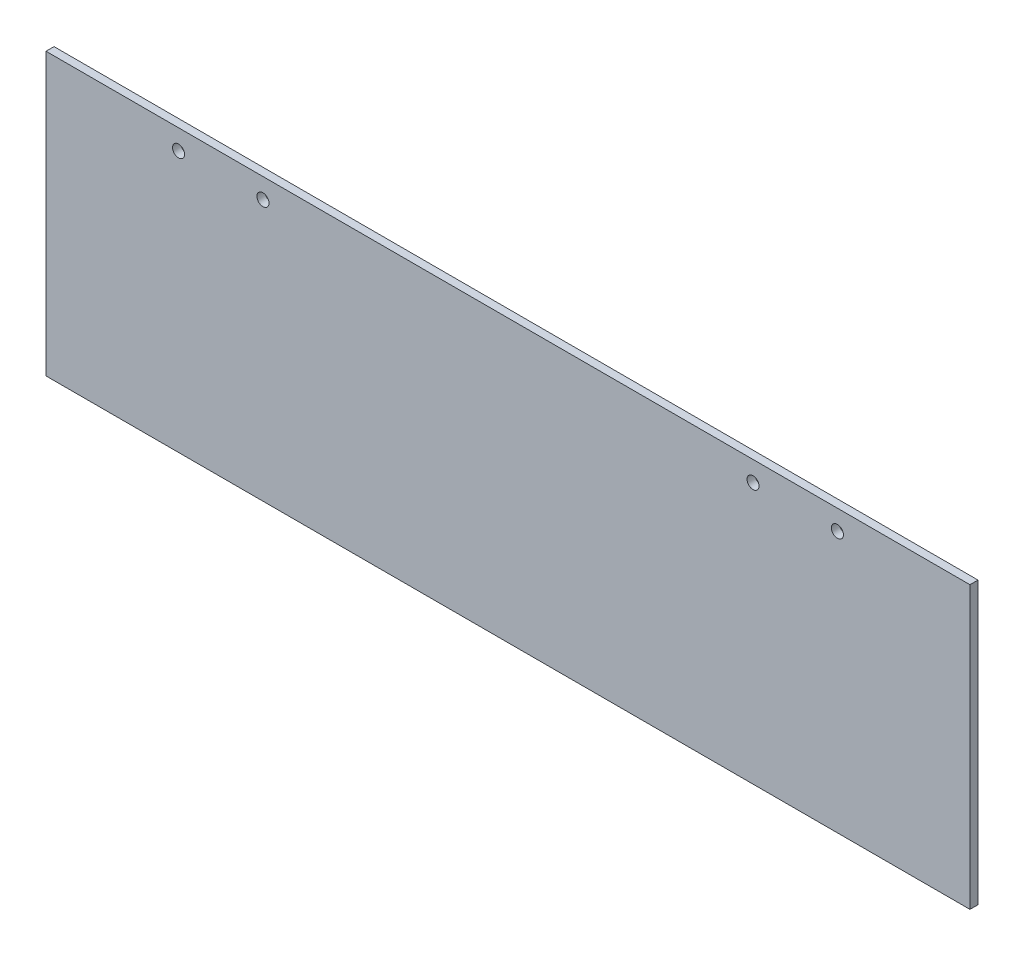
ISO-10303-21;
HEADER;
FILE_DESCRIPTION(('STEP AP214'),'2;1');
FILE_NAME('part.step','',(''),(''),'','','');
FILE_SCHEMA(('AUTOMOTIVE_DESIGN { 1 0 10303 214 1 1 1 1 }'));
ENDSEC;
DATA;
#1=APPLICATION_CONTEXT('core data for automotive mechanical design processes');
#2=APPLICATION_PROTOCOL_DEFINITION('international standard','automotive_design',2000,#1);
#3=PRODUCT_CONTEXT('',#1,'mechanical');
#4=PRODUCT('Part','Part','',(#3));
#5=PRODUCT_RELATED_PRODUCT_CATEGORY('part','',(#4));
#6=PRODUCT_DEFINITION_FORMATION('','',#4);
#7=PRODUCT_DEFINITION_CONTEXT('part definition',#1,'design');
#8=PRODUCT_DEFINITION('design','',#6,#7);
#9=PRODUCT_DEFINITION_SHAPE('','',#8);
#10=(LENGTH_UNIT() NAMED_UNIT(*) SI_UNIT(.MILLI.,.METRE.));
#11=(NAMED_UNIT(*) PLANE_ANGLE_UNIT() SI_UNIT($,.RADIAN.));
#12=(NAMED_UNIT(*) SI_UNIT($,.STERADIAN.) SOLID_ANGLE_UNIT());
#13=UNCERTAINTY_MEASURE_WITH_UNIT(LENGTH_MEASURE(1.E-05),#10,'distance_accuracy_value','');
#14=(GEOMETRIC_REPRESENTATION_CONTEXT(3) GLOBAL_UNCERTAINTY_ASSIGNED_CONTEXT((#13)) GLOBAL_UNIT_ASSIGNED_CONTEXT((#10,
#11,#12)) REPRESENTATION_CONTEXT('',''));
#15=CARTESIAN_POINT('',(0.,0.,0.));
#16=DIRECTION('',(0.,0.,1.));
#17=DIRECTION('',(1.,0.,0.));
#18=AXIS2_PLACEMENT_3D('',#15,#16,#17);
#19=CARTESIAN_POINT('',(0.,0.,2.));
#20=DIRECTION('',(0.,0.,1.));
#21=DIRECTION('',(1.,0.,0.));
#22=AXIS2_PLACEMENT_3D('',#19,#20,#21);
#23=PLANE('',#22);
#24=CARTESIAN_POINT('',(61.,30.,2.));
#25=DIRECTION('',(0.,0.,1.));
#26=DIRECTION('',(1.,0.,0.));
#27=AXIS2_PLACEMENT_3D('',#24,#25,#26);
#28=CIRCLE('',#27,1.5);
#29=CARTESIAN_POINT('',(62.5,30.,2.));
#30=VERTEX_POINT('',#29);
#31=EDGE_CURVE('E121',#30,#30,#28,.T.);
#32=ORIENTED_EDGE('',*,*,#31,.F.);
#33=EDGE_LOOP('',(#32));
#34=FACE_BOUND('',#33,.T.);
#35=CARTESIAN_POINT('',(-82.,30.,2.));
#36=DIRECTION('',(0.,0.,1.));
#37=DIRECTION('',(1.,0.,0.));
#38=AXIS2_PLACEMENT_3D('',#35,#36,#37);
#39=CIRCLE('',#38,1.5);
#40=CARTESIAN_POINT('',(-80.5,30.,2.));
#41=VERTEX_POINT('',#40);
#42=EDGE_CURVE('E100',#41,#41,#39,.T.);
#43=ORIENTED_EDGE('',*,*,#42,.F.);
#44=EDGE_LOOP('',(#43));
#45=FACE_BOUND('',#44,.T.);
#46=DIRECTION('',(0.,-1.,0.));
#47=VECTOR('',#46,1.);
#48=CARTESIAN_POINT('',(-115.,35.,2.));
#49=LINE('',#48,#47);
#50=CARTESIAN_POINT('',(-115.,35.,2.));
#51=VERTEX_POINT('',#50);
#52=CARTESIAN_POINT('',(-115.,-35.,2.));
#53=VERTEX_POINT('',#52);
#54=EDGE_CURVE('E85',#51,#53,#49,.T.);
#55=ORIENTED_EDGE('',*,*,#54,.T.);
#56=DIRECTION('',(1.,0.,0.));
#57=VECTOR('',#56,1.);
#58=CARTESIAN_POINT('',(-115.,-35.,2.));
#59=LINE('',#58,#57);
#60=CARTESIAN_POINT('',(115.,-35.,2.));
#61=VERTEX_POINT('',#60);
#62=EDGE_CURVE('E80',#53,#61,#59,.T.);
#63=ORIENTED_EDGE('',*,*,#62,.T.);
#64=DIRECTION('',(0.,1.,0.));
#65=VECTOR('',#64,1.);
#66=CARTESIAN_POINT('',(115.,35.,2.));
#67=LINE('',#66,#65);
#68=CARTESIAN_POINT('',(115.,35.,2.));
#69=VERTEX_POINT('',#68);
#70=EDGE_CURVE('E83',#61,#69,#67,.T.);
#71=ORIENTED_EDGE('',*,*,#70,.T.);
#72=DIRECTION('',(-1.,0.,0.));
#73=VECTOR('',#72,1.);
#74=CARTESIAN_POINT('',(-115.,35.,2.));
#75=LINE('',#74,#73);
#76=EDGE_CURVE('E50',#69,#51,#75,.T.);
#77=ORIENTED_EDGE('',*,*,#76,.T.);
#78=EDGE_LOOP('',(#55,#63,#71,#77));
#79=FACE_BOUND('',#78,.T.);
#80=CARTESIAN_POINT('',(-61.,30.,2.));
#81=DIRECTION('',(0.,0.,1.));
#82=DIRECTION('',(1.,0.,0.));
#83=AXIS2_PLACEMENT_3D('',#80,#81,#82);
#84=CIRCLE('',#83,1.5);
#85=CARTESIAN_POINT('',(-59.5,30.,2.));
#86=VERTEX_POINT('',#85);
#87=EDGE_CURVE('E115',#86,#86,#84,.T.);
#88=ORIENTED_EDGE('',*,*,#87,.F.);
#89=EDGE_LOOP('',(#88));
#90=FACE_BOUND('',#89,.T.);
#91=CARTESIAN_POINT('',(82.,30.,2.));
#92=DIRECTION('',(0.,0.,1.));
#93=DIRECTION('',(1.,0.,0.));
#94=AXIS2_PLACEMENT_3D('',#91,#92,#93);
#95=CIRCLE('',#94,1.5);
#96=CARTESIAN_POINT('',(83.5,30.,2.));
#97=VERTEX_POINT('',#96);
#98=EDGE_CURVE('E127',#97,#97,#95,.T.);
#99=ORIENTED_EDGE('',*,*,#98,.F.);
#100=EDGE_LOOP('',(#99));
#101=FACE_BOUND('',#100,.T.);
#102=ADVANCED_FACE('F33',(#34,#45,#79,#90,#101),#23,.T.);
#103=CARTESIAN_POINT('',(0.,0.,0.));
#104=DIRECTION('',(0.,0.,1.));
#105=DIRECTION('',(1.,0.,0.));
#106=AXIS2_PLACEMENT_3D('',#103,#104,#105);
#107=PLANE('',#106);
#108=CARTESIAN_POINT('',(61.,30.,0.));
#109=DIRECTION('',(0.,0.,1.));
#110=DIRECTION('',(1.,0.,0.));
#111=AXIS2_PLACEMENT_3D('',#108,#109,#110);
#112=CIRCLE('',#111,1.5);
#113=CARTESIAN_POINT('',(62.5,30.,0.));
#114=VERTEX_POINT('',#113);
#115=EDGE_CURVE('E124',#114,#114,#112,.T.);
#116=ORIENTED_EDGE('',*,*,#115,.T.);
#117=EDGE_LOOP('',(#116));
#118=FACE_BOUND('',#117,.T.);
#119=CARTESIAN_POINT('',(-82.,30.,0.));
#120=DIRECTION('',(0.,0.,1.));
#121=DIRECTION('',(1.,0.,0.));
#122=AXIS2_PLACEMENT_3D('',#119,#120,#121);
#123=CIRCLE('',#122,1.5);
#124=CARTESIAN_POINT('',(-80.5,30.,0.));
#125=VERTEX_POINT('',#124);
#126=EDGE_CURVE('E112',#125,#125,#123,.T.);
#127=ORIENTED_EDGE('',*,*,#126,.T.);
#128=EDGE_LOOP('',(#127));
#129=FACE_BOUND('',#128,.T.);
#130=DIRECTION('',(0.,-1.,0.));
#131=VECTOR('',#130,1.);
#132=CARTESIAN_POINT('',(-115.,35.,0.));
#133=LINE('',#132,#131);
#134=CARTESIAN_POINT('',(-115.,35.,0.));
#135=VERTEX_POINT('',#134);
#136=CARTESIAN_POINT('',(-115.,-35.,0.));
#137=VERTEX_POINT('',#136);
#138=EDGE_CURVE('E97',#135,#137,#133,.T.);
#139=ORIENTED_EDGE('',*,*,#138,.F.);
#140=DIRECTION('',(-1.,0.,0.));
#141=VECTOR('',#140,1.);
#142=CARTESIAN_POINT('',(-115.,35.,0.));
#143=LINE('',#142,#141);
#144=CARTESIAN_POINT('',(115.,35.,0.));
#145=VERTEX_POINT('',#144);
#146=EDGE_CURVE('E73',#145,#135,#143,.T.);
#147=ORIENTED_EDGE('',*,*,#146,.F.);
#148=DIRECTION('',(0.,1.,0.));
#149=VECTOR('',#148,1.);
#150=CARTESIAN_POINT('',(115.,35.,0.));
#151=LINE('',#150,#149);
#152=CARTESIAN_POINT('',(115.,-35.,0.));
#153=VERTEX_POINT('',#152);
#154=EDGE_CURVE('E67',#153,#145,#151,.T.);
#155=ORIENTED_EDGE('',*,*,#154,.F.);
#156=DIRECTION('',(1.,0.,0.));
#157=VECTOR('',#156,1.);
#158=CARTESIAN_POINT('',(-115.,-35.,0.));
#159=LINE('',#158,#157);
#160=EDGE_CURVE('E89',#137,#153,#159,.T.);
#161=ORIENTED_EDGE('',*,*,#160,.F.);
#162=EDGE_LOOP('',(#139,#147,#155,#161));
#163=FACE_BOUND('',#162,.T.);
#164=CARTESIAN_POINT('',(-61.,30.,0.));
#165=DIRECTION('',(0.,0.,1.));
#166=DIRECTION('',(1.,0.,0.));
#167=AXIS2_PLACEMENT_3D('',#164,#165,#166);
#168=CIRCLE('',#167,1.5);
#169=CARTESIAN_POINT('',(-59.5,30.,0.));
#170=VERTEX_POINT('',#169);
#171=EDGE_CURVE('E118',#170,#170,#168,.T.);
#172=ORIENTED_EDGE('',*,*,#171,.T.);
#173=EDGE_LOOP('',(#172));
#174=FACE_BOUND('',#173,.T.);
#175=CARTESIAN_POINT('',(82.,30.,0.));
#176=DIRECTION('',(0.,0.,1.));
#177=DIRECTION('',(1.,0.,0.));
#178=AXIS2_PLACEMENT_3D('',#175,#176,#177);
#179=CIRCLE('',#178,1.5);
#180=CARTESIAN_POINT('',(83.5,30.,0.));
#181=VERTEX_POINT('',#180);
#182=EDGE_CURVE('E130',#181,#181,#179,.T.);
#183=ORIENTED_EDGE('',*,*,#182,.T.);
#184=EDGE_LOOP('',(#183));
#185=FACE_BOUND('',#184,.T.);
#186=ADVANCED_FACE('F108',(#118,#129,#163,#174,#185),#107,.F.);
#187=CARTESIAN_POINT('',(-115.,35.,2.));
#188=DIRECTION('',(1.,0.,0.));
#189=DIRECTION('',(0.,1.,0.));
#190=AXIS2_PLACEMENT_3D('',#187,#188,#189);
#191=PLANE('',#190);
#192=ORIENTED_EDGE('',*,*,#138,.T.);
#193=DIRECTION('',(0.,0.,-1.));
#194=VECTOR('',#193,1.);
#195=CARTESIAN_POINT('',(-115.,-35.,2.));
#196=LINE('',#195,#194);
#197=EDGE_CURVE('E11',#53,#137,#196,.T.);
#198=ORIENTED_EDGE('',*,*,#197,.F.);
#199=ORIENTED_EDGE('',*,*,#54,.F.);
#200=DIRECTION('',(0.,0.,-1.));
#201=VECTOR('',#200,1.);
#202=CARTESIAN_POINT('',(-115.,35.,2.));
#203=LINE('',#202,#201);
#204=EDGE_CURVE('E93',#51,#135,#203,.T.);
#205=ORIENTED_EDGE('',*,*,#204,.T.);
#206=EDGE_LOOP('',(#192,#198,#199,#205));
#207=FACE_BOUND('',#206,.T.);
#208=ADVANCED_FACE('F35',(#207),#191,.F.);
#209=CARTESIAN_POINT('',(-115.,-35.,2.));
#210=DIRECTION('',(0.,1.,0.));
#211=DIRECTION('',(0.,0.,1.));
#212=AXIS2_PLACEMENT_3D('',#209,#210,#211);
#213=PLANE('',#212);
#214=ORIENTED_EDGE('',*,*,#160,.T.);
#215=DIRECTION('',(0.,0.,-1.));
#216=VECTOR('',#215,1.);
#217=CARTESIAN_POINT('',(115.,-35.,2.));
#218=LINE('',#217,#216);
#219=EDGE_CURVE('E42',#61,#153,#218,.T.);
#220=ORIENTED_EDGE('',*,*,#219,.F.);
#221=ORIENTED_EDGE('',*,*,#62,.F.);
#222=ORIENTED_EDGE('',*,*,#197,.T.);
#223=EDGE_LOOP('',(#214,#220,#221,#222));
#224=FACE_BOUND('',#223,.T.);
#225=ADVANCED_FACE('F88',(#224),#213,.F.);
#226=CARTESIAN_POINT('',(115.,35.,2.));
#227=DIRECTION('',(-1.,0.,0.));
#228=DIRECTION('',(0.,0.,1.));
#229=AXIS2_PLACEMENT_3D('',#226,#227,#228);
#230=PLANE('',#229);
#231=ORIENTED_EDGE('',*,*,#154,.T.);
#232=DIRECTION('',(0.,0.,-1.));
#233=VECTOR('',#232,1.);
#234=CARTESIAN_POINT('',(115.,35.,2.));
#235=LINE('',#234,#233);
#236=EDGE_CURVE('E90',#69,#145,#235,.T.);
#237=ORIENTED_EDGE('',*,*,#236,.F.);
#238=ORIENTED_EDGE('',*,*,#70,.F.);
#239=ORIENTED_EDGE('',*,*,#219,.T.);
#240=EDGE_LOOP('',(#231,#237,#238,#239));
#241=FACE_BOUND('',#240,.T.);
#242=ADVANCED_FACE('F91',(#241),#230,.F.);
#243=CARTESIAN_POINT('',(-115.,35.,2.));
#244=DIRECTION('',(0.,-1.,0.));
#245=DIRECTION('',(0.,0.,-1.));
#246=AXIS2_PLACEMENT_3D('',#243,#244,#245);
#247=PLANE('',#246);
#248=ORIENTED_EDGE('',*,*,#146,.T.);
#249=ORIENTED_EDGE('',*,*,#204,.F.);
#250=ORIENTED_EDGE('',*,*,#76,.F.);
#251=ORIENTED_EDGE('',*,*,#236,.T.);
#252=EDGE_LOOP('',(#248,#249,#250,#251));
#253=FACE_BOUND('',#252,.T.);
#254=ADVANCED_FACE('F105',(#253),#247,.F.);
#255=CARTESIAN_POINT('',(-82.,30.,2.));
#256=DIRECTION('',(0.,0.,-1.));
#257=DIRECTION('',(-1.,0.,0.));
#258=AXIS2_PLACEMENT_3D('',#255,#256,#257);
#259=CYLINDRICAL_SURFACE('',#258,1.5);
#260=ORIENTED_EDGE('',*,*,#42,.T.);
#261=EDGE_LOOP('',(#260));
#262=FACE_BOUND('',#261,.T.);
#263=ORIENTED_EDGE('',*,*,#126,.F.);
#264=EDGE_LOOP('',(#263));
#265=FACE_BOUND('',#264,.T.);
#266=ADVANCED_FACE('F150',(#262,#265),#259,.F.);
#267=CARTESIAN_POINT('',(-61.,30.,2.));
#268=DIRECTION('',(0.,0.,-1.));
#269=DIRECTION('',(-1.,0.,0.));
#270=AXIS2_PLACEMENT_3D('',#267,#268,#269);
#271=CYLINDRICAL_SURFACE('',#270,1.5);
#272=ORIENTED_EDGE('',*,*,#87,.T.);
#273=EDGE_LOOP('',(#272));
#274=FACE_BOUND('',#273,.T.);
#275=ORIENTED_EDGE('',*,*,#171,.F.);
#276=EDGE_LOOP('',(#275));
#277=FACE_BOUND('',#276,.T.);
#278=ADVANCED_FACE('F196',(#274,#277),#271,.F.);
#279=CARTESIAN_POINT('',(61.,30.,2.));
#280=DIRECTION('',(0.,0.,-1.));
#281=DIRECTION('',(-1.,0.,0.));
#282=AXIS2_PLACEMENT_3D('',#279,#280,#281);
#283=CYLINDRICAL_SURFACE('',#282,1.5);
#284=ORIENTED_EDGE('',*,*,#31,.T.);
#285=EDGE_LOOP('',(#284));
#286=FACE_BOUND('',#285,.T.);
#287=ORIENTED_EDGE('',*,*,#115,.F.);
#288=EDGE_LOOP('',(#287));
#289=FACE_BOUND('',#288,.T.);
#290=ADVANCED_FACE('F204',(#286,#289),#283,.F.);
#291=CARTESIAN_POINT('',(82.,30.,2.));
#292=DIRECTION('',(0.,0.,-1.));
#293=DIRECTION('',(-1.,0.,0.));
#294=AXIS2_PLACEMENT_3D('',#291,#292,#293);
#295=CYLINDRICAL_SURFACE('',#294,1.5);
#296=ORIENTED_EDGE('',*,*,#98,.T.);
#297=EDGE_LOOP('',(#296));
#298=FACE_BOUND('',#297,.T.);
#299=ORIENTED_EDGE('',*,*,#182,.F.);
#300=EDGE_LOOP('',(#299));
#301=FACE_BOUND('',#300,.T.);
#302=ADVANCED_FACE('F136',(#298,#301),#295,.F.);
#303=CLOSED_SHELL('',(#102,#186,#208,#225,#242,#254,#266,#278,#290,#302));
#304=MANIFOLD_SOLID_BREP('B2',#303);
#305=ADVANCED_BREP_SHAPE_REPRESENTATION('',(#18,#304),#14);
#306=SHAPE_DEFINITION_REPRESENTATION(#9,#305);
ENDSEC;
END-ISO-10303-21;
